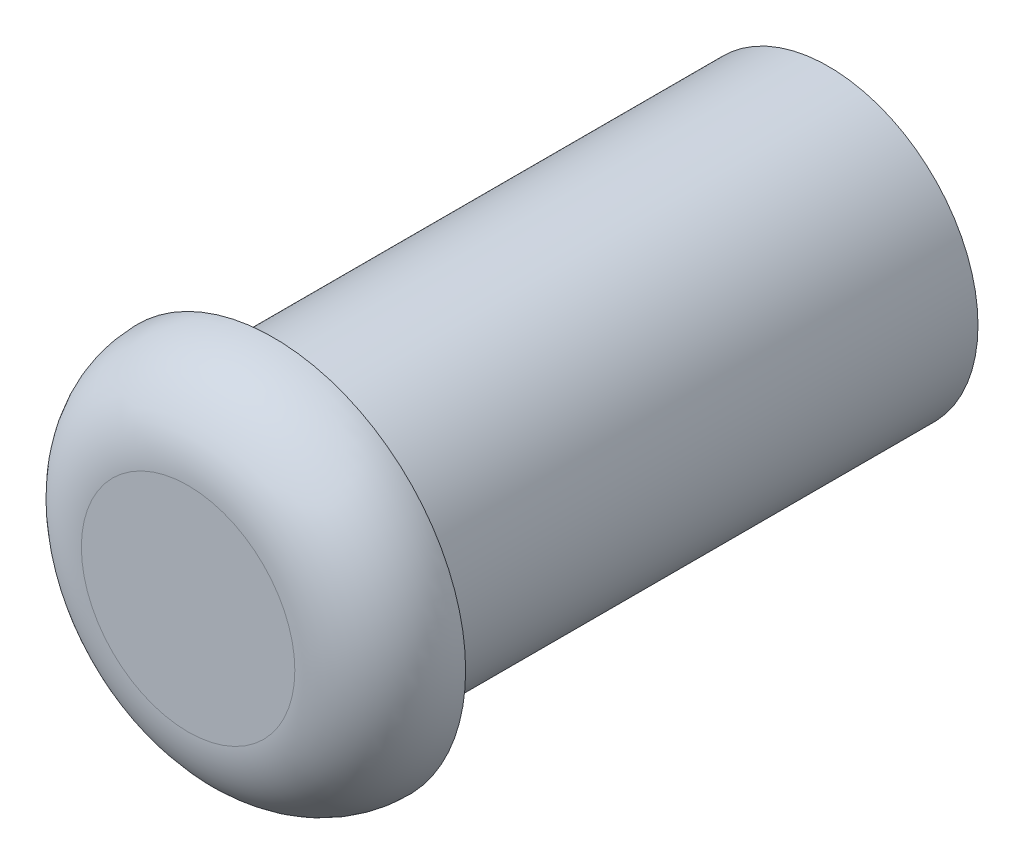
ISO-10303-21;
HEADER;
FILE_DESCRIPTION(('STEP AP214'),'2;1');
FILE_NAME('part.step','',(''),(''),'','','');
FILE_SCHEMA(('AUTOMOTIVE_DESIGN { 1 0 10303 214 1 1 1 1 }'));
ENDSEC;
DATA;
#1=APPLICATION_CONTEXT('core data for automotive mechanical design processes');
#2=APPLICATION_PROTOCOL_DEFINITION('international standard','automotive_design',2000,#1);
#3=PRODUCT_CONTEXT('',#1,'mechanical');
#4=PRODUCT('Part','Part','',(#3));
#5=PRODUCT_RELATED_PRODUCT_CATEGORY('part','',(#4));
#6=PRODUCT_DEFINITION_FORMATION('','',#4);
#7=PRODUCT_DEFINITION_CONTEXT('part definition',#1,'design');
#8=PRODUCT_DEFINITION('design','',#6,#7);
#9=PRODUCT_DEFINITION_SHAPE('','',#8);
#10=(LENGTH_UNIT() NAMED_UNIT(*) SI_UNIT(.MILLI.,.METRE.));
#11=(NAMED_UNIT(*) PLANE_ANGLE_UNIT() SI_UNIT($,.RADIAN.));
#12=(NAMED_UNIT(*) SI_UNIT($,.STERADIAN.) SOLID_ANGLE_UNIT());
#13=UNCERTAINTY_MEASURE_WITH_UNIT(LENGTH_MEASURE(1.E-05),#10,'distance_accuracy_value','');
#14=(GEOMETRIC_REPRESENTATION_CONTEXT(3) GLOBAL_UNCERTAINTY_ASSIGNED_CONTEXT((#13)) GLOBAL_UNIT_ASSIGNED_CONTEXT((#10,
#11,#12)) REPRESENTATION_CONTEXT('',''));
#15=CARTESIAN_POINT('',(0.,0.,0.));
#16=DIRECTION('',(0.,0.,1.));
#17=DIRECTION('',(1.,0.,0.));
#18=AXIS2_PLACEMENT_3D('',#15,#16,#17);
#19=CARTESIAN_POINT('',(0.,0.,13.));
#20=DIRECTION('',(0.,0.,-1.));
#21=DIRECTION('',(-1.,0.,0.));
#22=AXIS2_PLACEMENT_3D('',#19,#20,#21);
#23=CYLINDRICAL_SURFACE('',#22,3.5);
#24=CARTESIAN_POINT('',(0.,0.,13.));
#25=DIRECTION('',(0.,0.,1.));
#26=DIRECTION('',(1.,0.,0.));
#27=AXIS2_PLACEMENT_3D('',#24,#25,#26);
#28=CIRCLE('',#27,3.5);
#29=CARTESIAN_POINT('',(-3.5,0.,13.));
#30=VERTEX_POINT('',#29);
#31=EDGE_CURVE('E44',#30,#30,#28,.T.);
#32=CARTESIAN_POINT('',(0.,0.,0.));
#33=DIRECTION('',(0.,0.,1.));
#34=DIRECTION('',(1.,0.,0.));
#35=AXIS2_PLACEMENT_3D('',#32,#33,#34);
#36=CIRCLE('',#35,3.5);
#37=CARTESIAN_POINT('',(-3.5,0.,0.));
#38=VERTEX_POINT('',#37);
#39=EDGE_CURVE('E48',#38,#38,#36,.T.);
#40=CARTESIAN_POINT('',(-3.5,0.,13.));
#41=CARTESIAN_POINT('',(-3.5,0.,12.8645833333333));
#42=CARTESIAN_POINT('',(-3.5,0.,12.7291666666667));
#43=CARTESIAN_POINT('',(-3.5,0.,12.4583333333333));
#44=CARTESIAN_POINT('',(-3.5,0.,12.3229166666667));
#45=CARTESIAN_POINT('',(-3.5,0.,12.0520833333333));
#46=CARTESIAN_POINT('',(-3.5,0.,11.9166666666667));
#47=CARTESIAN_POINT('',(-3.5,0.,11.6458333333333));
#48=CARTESIAN_POINT('',(-3.5,0.,11.5104166666667));
#49=CARTESIAN_POINT('',(-3.5,0.,11.2395833333333));
#50=CARTESIAN_POINT('',(-3.5,0.,11.1041666666667));
#51=CARTESIAN_POINT('',(-3.5,0.,10.8333333333333));
#52=CARTESIAN_POINT('',(-3.5,0.,10.6979166666667));
#53=CARTESIAN_POINT('',(-3.5,0.,10.4270833333333));
#54=CARTESIAN_POINT('',(-3.5,0.,10.2916666666667));
#55=CARTESIAN_POINT('',(-3.5,0.,10.0208333333333));
#56=CARTESIAN_POINT('',(-3.5,0.,9.88541666666667));
#57=CARTESIAN_POINT('',(-3.5,0.,9.61458333333333));
#58=CARTESIAN_POINT('',(-3.5,0.,9.47916666666667));
#59=CARTESIAN_POINT('',(-3.5,0.,9.20833333333333));
#60=CARTESIAN_POINT('',(-3.5,0.,9.07291666666667));
#61=CARTESIAN_POINT('',(-3.5,0.,8.80208333333333));
#62=CARTESIAN_POINT('',(-3.5,0.,8.66666666666667));
#63=CARTESIAN_POINT('',(-3.5,0.,8.39583333333333));
#64=CARTESIAN_POINT('',(-3.5,0.,8.26041666666667));
#65=CARTESIAN_POINT('',(-3.5,0.,7.98958333333333));
#66=CARTESIAN_POINT('',(-3.5,0.,7.85416666666667));
#67=CARTESIAN_POINT('',(-3.5,0.,7.58333333333333));
#68=CARTESIAN_POINT('',(-3.5,0.,7.44791666666667));
#69=CARTESIAN_POINT('',(-3.5,0.,7.17708333333333));
#70=CARTESIAN_POINT('',(-3.5,0.,7.04166666666667));
#71=CARTESIAN_POINT('',(-3.5,0.,6.77083333333333));
#72=CARTESIAN_POINT('',(-3.5,0.,6.63541666666667));
#73=CARTESIAN_POINT('',(-3.5,0.,6.36458333333333));
#74=CARTESIAN_POINT('',(-3.5,0.,6.22916666666667));
#75=CARTESIAN_POINT('',(-3.5,0.,5.95833333333333));
#76=CARTESIAN_POINT('',(-3.5,0.,5.82291666666667));
#77=CARTESIAN_POINT('',(-3.5,0.,5.55208333333333));
#78=CARTESIAN_POINT('',(-3.5,0.,5.41666666666667));
#79=CARTESIAN_POINT('',(-3.5,0.,5.14583333333333));
#80=CARTESIAN_POINT('',(-3.5,0.,5.01041666666667));
#81=CARTESIAN_POINT('',(-3.5,0.,4.73958333333333));
#82=CARTESIAN_POINT('',(-3.5,0.,4.60416666666667));
#83=CARTESIAN_POINT('',(-3.5,0.,4.33333333333333));
#84=CARTESIAN_POINT('',(-3.5,0.,4.19791666666667));
#85=CARTESIAN_POINT('',(-3.5,0.,3.92708333333333));
#86=CARTESIAN_POINT('',(-3.5,0.,3.79166666666667));
#87=CARTESIAN_POINT('',(-3.5,0.,3.52083333333333));
#88=CARTESIAN_POINT('',(-3.5,0.,3.38541666666667));
#89=CARTESIAN_POINT('',(-3.5,0.,3.11458333333333));
#90=CARTESIAN_POINT('',(-3.5,0.,2.97916666666667));
#91=CARTESIAN_POINT('',(-3.5,0.,2.70833333333333));
#92=CARTESIAN_POINT('',(-3.5,0.,2.57291666666667));
#93=CARTESIAN_POINT('',(-3.5,0.,2.30208333333333));
#94=CARTESIAN_POINT('',(-3.5,0.,2.16666666666667));
#95=CARTESIAN_POINT('',(-3.5,0.,1.89583333333333));
#96=CARTESIAN_POINT('',(-3.5,0.,1.76041666666667));
#97=CARTESIAN_POINT('',(-3.5,0.,1.48958333333333));
#98=CARTESIAN_POINT('',(-3.5,0.,1.35416666666667));
#99=CARTESIAN_POINT('',(-3.5,0.,1.08333333333333));
#100=CARTESIAN_POINT('',(-3.5,0.,0.947916666666667));
#101=CARTESIAN_POINT('',(-3.5,0.,0.677083333333334));
#102=CARTESIAN_POINT('',(-3.5,0.,0.541666666666667));
#103=CARTESIAN_POINT('',(-3.5,0.,0.270833333333334));
#104=CARTESIAN_POINT('',(-3.5,0.,0.135416666666667));
#105=CARTESIAN_POINT('',(-3.5,0.,0.));
#106=B_SPLINE_CURVE_WITH_KNOTS('',3,(#40,#41,#42,#43,#44,#45,#46,#47,#48,#49,#50,#51,#52,#53,
#54,#55,#56,#57,#58,#59,#60,#61,#62,#63,#64,#65,#66,#67,#68,#69,#70,#71,#72,#73,#74,#75,#76,#77,
#78,#79,#80,#81,#82,#83,#84,#85,#86,#87,#88,#89,#90,#91,#92,#93,#94,#95,#96,#97,#98,#99,#100,
#101,#102,#103,#104,#105),.UNSPECIFIED.,.F.,.F.,(4,2,2,2,2,2,2,2,2,2,2,2,2,2,2,2,2,2,2,2,2,2,2,
2,2,2,2,2,2,2,2,2,4),(0.,0.406249999999999,0.812499999999999,1.21875,1.625,2.03125,2.4375,
2.84375,3.25,3.65625,4.0625,4.46875,4.875,5.28125,5.6875,6.09375,6.5,6.90625,7.3125,7.71875,
8.125,8.53125,8.9375,9.34375,9.75,10.15625,10.5625,10.96875,11.375,11.78125,12.1875,12.59375,
13.),.UNSPECIFIED.);
#107=EDGE_CURVE('BSEAM37',#30,#38,#106,.T.);
#108=ORIENTED_EDGE('',*,*,#31,.F.);
#109=ORIENTED_EDGE('',*,*,#39,.T.);
#110=ORIENTED_EDGE('',*,*,#107,.T.);
#111=ORIENTED_EDGE('',*,*,#107,.F.);
#112=EDGE_LOOP('',(#108,#110,#109,#111));
#113=FACE_BOUND('',#112,.T.);
#114=ADVANCED_FACE('F37',(#113),#23,.T.);
#115=CARTESIAN_POINT('',(0.,0.,0.));
#116=DIRECTION('',(0.,0.,1.));
#117=DIRECTION('',(1.,0.,0.));
#118=AXIS2_PLACEMENT_3D('',#115,#116,#117);
#119=PLANE('',#118);
#120=ORIENTED_EDGE('',*,*,#39,.F.);
#121=EDGE_LOOP('',(#120));
#122=FACE_BOUND('',#121,.T.);
#123=ADVANCED_FACE('F68',(#122),#119,.F.);
#124=CARTESIAN_POINT('',(0.,0.,15.));
#125=DIRECTION('',(0.,0.,1.));
#126=DIRECTION('',(1.,0.,0.));
#127=AXIS2_PLACEMENT_3D('',#124,#125,#126);
#128=PLANE('',#127);
#129=CARTESIAN_POINT('',(0.,0.,15.));
#130=DIRECTION('',(0.,0.,1.));
#131=DIRECTION('',(1.,0.,0.));
#132=AXIS2_PLACEMENT_3D('',#129,#130,#131);
#133=CIRCLE('',#132,2.5);
#134=CARTESIAN_POINT('',(2.5,0.,15.));
#135=VERTEX_POINT('',#134);
#136=EDGE_CURVE('E10',#135,#135,#133,.T.);
#137=ORIENTED_EDGE('',*,*,#136,.T.);
#138=EDGE_LOOP('',(#137));
#139=FACE_BOUND('',#138,.T.);
#140=ADVANCED_FACE('F62',(#139),#128,.T.);
#141=CARTESIAN_POINT('',(0.,0.,13.));
#142=DIRECTION('',(0.,0.,1.));
#143=DIRECTION('',(1.,0.,0.));
#144=AXIS2_PLACEMENT_3D('',#141,#142,#143);
#145=PLANE('',#144);
#146=ORIENTED_EDGE('',*,*,#31,.T.);
#147=EDGE_LOOP('',(#146));
#148=FACE_BOUND('',#147,.T.);
#149=CARTESIAN_POINT('',(0.,0.,13.));
#150=DIRECTION('',(0.,0.,1.));
#151=DIRECTION('',(1.,0.,0.));
#152=AXIS2_PLACEMENT_3D('',#149,#150,#151);
#153=CIRCLE('',#152,4.5);
#154=CARTESIAN_POINT('',(4.5,0.,13.));
#155=VERTEX_POINT('',#154);
#156=EDGE_CURVE('E53',#155,#155,#153,.T.);
#157=ORIENTED_EDGE('',*,*,#156,.F.);
#158=EDGE_LOOP('',(#157));
#159=FACE_BOUND('',#158,.T.);
#160=ADVANCED_FACE('F60',(#148,#159),#145,.F.);
#161=CARTESIAN_POINT('',(0.,0.,13.));
#162=DIRECTION('',(0.,0.,1.));
#163=DIRECTION('',(1.,0.,0.));
#164=AXIS2_PLACEMENT_3D('',#161,#162,#163);
#165=TOROIDAL_SURFACE('',#164,2.5,2.);
#166=ORIENTED_EDGE('',*,*,#156,.T.);
#167=EDGE_LOOP('',(#166));
#168=FACE_BOUND('',#167,.T.);
#169=ORIENTED_EDGE('',*,*,#136,.F.);
#170=EDGE_LOOP('',(#169));
#171=FACE_BOUND('',#170,.T.);
#172=ADVANCED_FACE('F39',(#168,#171),#165,.T.);
#173=CLOSED_SHELL('',(#114,#123,#140,#160,#172));
#174=MANIFOLD_SOLID_BREP('B2',#173);
#175=ADVANCED_BREP_SHAPE_REPRESENTATION('',(#18,#174),#14);
#176=SHAPE_DEFINITION_REPRESENTATION(#9,#175);
ENDSEC;
END-ISO-10303-21;
